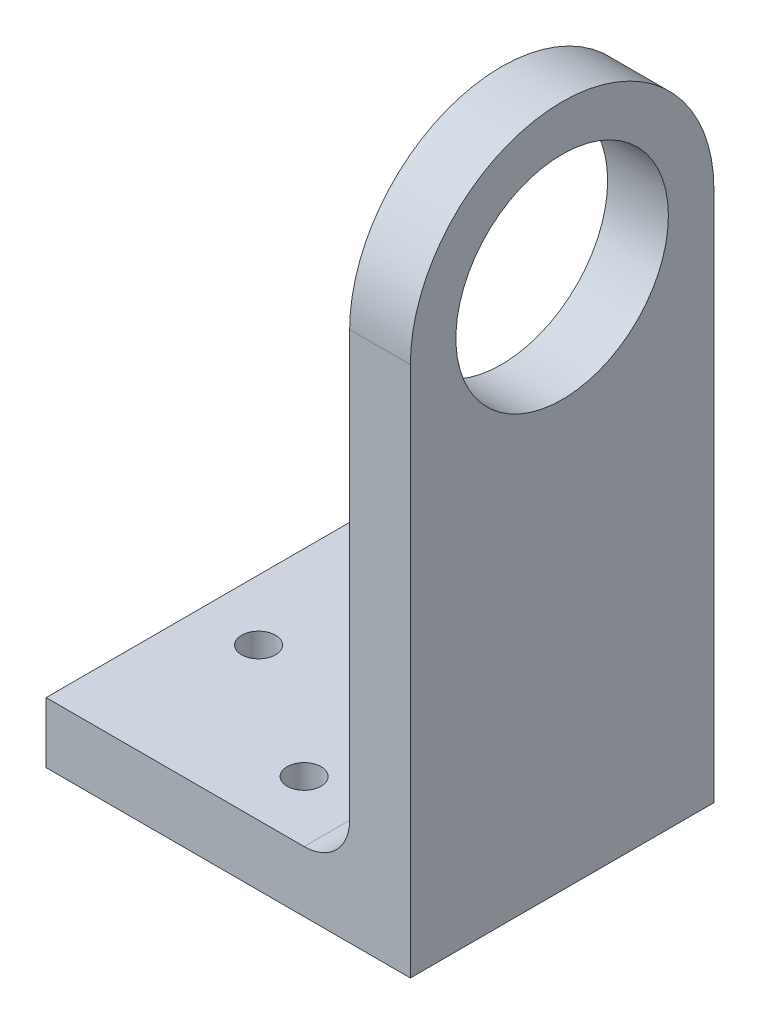
ISO-10303-21;
HEADER;
FILE_DESCRIPTION(('STEP AP214'),'2;1');
FILE_NAME('part.step','',(''),(''),'','','');
FILE_SCHEMA(('AUTOMOTIVE_DESIGN { 1 0 10303 214 1 1 1 1 }'));
ENDSEC;
DATA;
#1=APPLICATION_CONTEXT('core data for automotive mechanical design processes');
#2=APPLICATION_PROTOCOL_DEFINITION('international standard','automotive_design',2000,#1);
#3=PRODUCT_CONTEXT('',#1,'mechanical');
#4=PRODUCT('Part','Part','',(#3));
#5=PRODUCT_RELATED_PRODUCT_CATEGORY('part','',(#4));
#6=PRODUCT_DEFINITION_FORMATION('','',#4);
#7=PRODUCT_DEFINITION_CONTEXT('part definition',#1,'design');
#8=PRODUCT_DEFINITION('design','',#6,#7);
#9=PRODUCT_DEFINITION_SHAPE('','',#8);
#10=(LENGTH_UNIT() NAMED_UNIT(*) SI_UNIT(.MILLI.,.METRE.));
#11=(NAMED_UNIT(*) PLANE_ANGLE_UNIT() SI_UNIT($,.RADIAN.));
#12=(NAMED_UNIT(*) SI_UNIT($,.STERADIAN.) SOLID_ANGLE_UNIT());
#13=UNCERTAINTY_MEASURE_WITH_UNIT(LENGTH_MEASURE(1.E-05),#10,'distance_accuracy_value','');
#14=(GEOMETRIC_REPRESENTATION_CONTEXT(3) GLOBAL_UNCERTAINTY_ASSIGNED_CONTEXT((#13)) GLOBAL_UNIT_ASSIGNED_CONTEXT((#10,
#11,#12)) REPRESENTATION_CONTEXT('',''));
#15=CARTESIAN_POINT('',(0.,0.,0.));
#16=DIRECTION('',(0.,0.,1.));
#17=DIRECTION('',(1.,0.,0.));
#18=AXIS2_PLACEMENT_3D('',#15,#16,#17);
#19=CARTESIAN_POINT('',(6.35,49.2125,-15.875));
#20=DIRECTION('',(-1.,0.,0.));
#21=DIRECTION('',(0.,0.,1.));
#22=AXIS2_PLACEMENT_3D('',#19,#20,#21);
#23=PLANE('',#22);
#24=DIRECTION('',(0.,-1.,0.));
#25=VECTOR('',#24,1.);
#26=CARTESIAN_POINT('',(6.35,0.,0.));
#27=LINE('',#26,#25);
#28=CARTESIAN_POINT('',(6.35,49.2125,0.));
#29=VERTEX_POINT('',#28);
#30=CARTESIAN_POINT('',(6.35,-6.35,0.));
#31=VERTEX_POINT('',#30);
#32=EDGE_CURVE('E141',#29,#31,#27,.T.);
#33=ORIENTED_EDGE('',*,*,#32,.T.);
#34=DIRECTION('',(0.,0.,-1.));
#35=VECTOR('',#34,1.);
#36=CARTESIAN_POINT('',(6.35,-6.35,0.));
#37=LINE('',#36,#35);
#38=CARTESIAN_POINT('',(6.35,-6.34999999999999,-31.75));
#39=VERTEX_POINT('',#38);
#40=EDGE_CURVE('E101',#31,#39,#37,.T.);
#41=ORIENTED_EDGE('',*,*,#40,.T.);
#42=DIRECTION('',(0.,1.,0.));
#43=VECTOR('',#42,1.);
#44=CARTESIAN_POINT('',(6.35,0.,-31.75));
#45=LINE('',#44,#43);
#46=CARTESIAN_POINT('',(6.35,49.2125,-31.75));
#47=VERTEX_POINT('',#46);
#48=EDGE_CURVE('E143',#39,#47,#45,.T.);
#49=ORIENTED_EDGE('',*,*,#48,.T.);
#50=CARTESIAN_POINT('',(6.35,49.2125,-15.875));
#51=DIRECTION('',(1.,0.,0.));
#52=DIRECTION('',(0.,0.,1.));
#53=AXIS2_PLACEMENT_3D('',#50,#51,#52);
#54=CIRCLE('',#53,15.875);
#55=EDGE_CURVE('E146',#47,#29,#54,.T.);
#56=ORIENTED_EDGE('',*,*,#55,.T.);
#57=EDGE_LOOP('',(#33,#41,#49,#56));
#58=FACE_BOUND('',#57,.T.);
#59=CARTESIAN_POINT('',(6.35,49.2125,-15.875));
#60=DIRECTION('',(1.,0.,0.));
#61=DIRECTION('',(0.,0.,-1.));
#62=AXIS2_PLACEMENT_3D('',#59,#60,#61);
#63=CIRCLE('',#62,11.1125);
#64=CARTESIAN_POINT('',(6.35,49.2125,-26.9875));
#65=VERTEX_POINT('',#64);
#66=EDGE_CURVE('E135',#65,#65,#63,.T.);
#67=ORIENTED_EDGE('',*,*,#66,.F.);
#68=EDGE_LOOP('',(#67));
#69=FACE_BOUND('',#68,.T.);
#70=ADVANCED_FACE('F36',(#58,#69),#23,.F.);
#71=CARTESIAN_POINT('',(0.,49.2125,-15.875));
#72=DIRECTION('',(-1.,0.,0.));
#73=DIRECTION('',(0.,0.,1.));
#74=AXIS2_PLACEMENT_3D('',#71,#72,#73);
#75=PLANE('',#74);
#76=DIRECTION('',(0.,1.,0.));
#77=VECTOR('',#76,1.);
#78=CARTESIAN_POINT('',(0.,0.,-31.75));
#79=LINE('',#78,#77);
#80=CARTESIAN_POINT('',(0.,4.76250000000001,-31.75));
#81=VERTEX_POINT('',#80);
#82=CARTESIAN_POINT('',(0.,49.2125,-31.75));
#83=VERTEX_POINT('',#82);
#84=EDGE_CURVE('E150',#81,#83,#79,.T.);
#85=ORIENTED_EDGE('',*,*,#84,.F.);
#86=DIRECTION('',(0.,0.,-1.));
#87=VECTOR('',#86,1.);
#88=CARTESIAN_POINT('',(0.,4.7625,0.));
#89=LINE('',#88,#87);
#90=CARTESIAN_POINT('',(0.,4.7625,0.));
#91=VERTEX_POINT('',#90);
#92=EDGE_CURVE('E57',#81,#91,#89,.F.);
#93=ORIENTED_EDGE('',*,*,#92,.T.);
#94=DIRECTION('',(0.,-1.,0.));
#95=VECTOR('',#94,1.);
#96=CARTESIAN_POINT('',(0.,0.,0.));
#97=LINE('',#96,#95);
#98=CARTESIAN_POINT('',(0.,49.2125,0.));
#99=VERTEX_POINT('',#98);
#100=EDGE_CURVE('E138',#99,#91,#97,.T.);
#101=ORIENTED_EDGE('',*,*,#100,.F.);
#102=CARTESIAN_POINT('',(0.,49.2125,-15.875));
#103=DIRECTION('',(1.,0.,0.));
#104=DIRECTION('',(0.,0.,1.));
#105=AXIS2_PLACEMENT_3D('',#102,#103,#104);
#106=CIRCLE('',#105,15.875);
#107=EDGE_CURVE('E144',#83,#99,#106,.T.);
#108=ORIENTED_EDGE('',*,*,#107,.F.);
#109=EDGE_LOOP('',(#85,#93,#101,#108));
#110=FACE_BOUND('',#109,.T.);
#111=CARTESIAN_POINT('',(0.,49.2125,-15.875));
#112=DIRECTION('',(1.,0.,0.));
#113=DIRECTION('',(0.,0.,-1.));
#114=AXIS2_PLACEMENT_3D('',#111,#112,#113);
#115=CIRCLE('',#114,11.1125);
#116=CARTESIAN_POINT('',(0.,49.2125,-26.9875));
#117=VERTEX_POINT('',#116);
#118=EDGE_CURVE('E131',#117,#117,#115,.T.);
#119=ORIENTED_EDGE('',*,*,#118,.T.);
#120=EDGE_LOOP('',(#119));
#121=FACE_BOUND('',#120,.T.);
#122=ADVANCED_FACE('F174',(#110,#121),#75,.T.);
#123=CARTESIAN_POINT('',(6.35,0.,0.));
#124=DIRECTION('',(0.,0.,-1.));
#125=DIRECTION('',(-1.,0.,0.));
#126=AXIS2_PLACEMENT_3D('',#123,#124,#125);
#127=PLANE('',#126);
#128=ORIENTED_EDGE('',*,*,#100,.T.);
#129=CARTESIAN_POINT('',(-4.7625,4.7625,0.));
#130=DIRECTION('',(0.,0.,-1.));
#131=DIRECTION('',(-1.,0.,0.));
#132=AXIS2_PLACEMENT_3D('',#129,#130,#131);
#133=CIRCLE('',#132,4.7625);
#134=CARTESIAN_POINT('',(-4.76250000000001,0.,0.));
#135=VERTEX_POINT('',#134);
#136=EDGE_CURVE('E11',#91,#135,#133,.T.);
#137=ORIENTED_EDGE('',*,*,#136,.T.);
#138=DIRECTION('',(1.,0.,0.));
#139=VECTOR('',#138,1.);
#140=CARTESIAN_POINT('',(-31.75,0.,0.));
#141=LINE('',#140,#139);
#142=CARTESIAN_POINT('',(-31.75,0.,0.));
#143=VERTEX_POINT('',#142);
#144=EDGE_CURVE('E120',#143,#135,#141,.T.);
#145=ORIENTED_EDGE('',*,*,#144,.F.);
#146=DIRECTION('',(0.,-1.,0.));
#147=VECTOR('',#146,1.);
#148=CARTESIAN_POINT('',(-31.75,0.,0.));
#149=LINE('',#148,#147);
#150=CARTESIAN_POINT('',(-31.75,-6.35,0.));
#151=VERTEX_POINT('',#150);
#152=EDGE_CURVE('E113',#143,#151,#149,.T.);
#153=ORIENTED_EDGE('',*,*,#152,.T.);
#154=DIRECTION('',(1.,0.,0.));
#155=VECTOR('',#154,1.);
#156=CARTESIAN_POINT('',(-31.75,-6.35,0.));
#157=LINE('',#156,#155);
#158=EDGE_CURVE('E95',#151,#31,#157,.T.);
#159=ORIENTED_EDGE('',*,*,#158,.T.);
#160=ORIENTED_EDGE('',*,*,#32,.F.);
#161=DIRECTION('',(-1.,0.,0.));
#162=VECTOR('',#161,1.);
#163=CARTESIAN_POINT('',(6.35,49.2125,0.));
#164=LINE('',#163,#162);
#165=EDGE_CURVE('E148',#29,#99,#164,.T.);
#166=ORIENTED_EDGE('',*,*,#165,.T.);
#167=EDGE_LOOP('',(#128,#137,#145,#153,#159,#160,#166));
#168=FACE_BOUND('',#167,.T.);
#169=ADVANCED_FACE('F118',(#168),#127,.F.);
#170=CARTESIAN_POINT('',(6.35,0.,-31.75));
#171=DIRECTION('',(0.,0.,1.));
#172=DIRECTION('',(1.,0.,0.));
#173=AXIS2_PLACEMENT_3D('',#170,#171,#172);
#174=PLANE('',#173);
#175=DIRECTION('',(1.,0.,0.));
#176=VECTOR('',#175,1.);
#177=CARTESIAN_POINT('',(-31.75,0.,-31.75));
#178=LINE('',#177,#176);
#179=CARTESIAN_POINT('',(-31.75,0.,-31.75));
#180=VERTEX_POINT('',#179);
#181=CARTESIAN_POINT('',(-4.76250000000001,0.,-31.75));
#182=VERTEX_POINT('',#181);
#183=EDGE_CURVE('E132',#180,#182,#178,.T.);
#184=ORIENTED_EDGE('',*,*,#183,.T.);
#185=CARTESIAN_POINT('',(-4.7625,4.76250000000001,-31.75));
#186=DIRECTION('',(0.,0.,1.));
#187=DIRECTION('',(1.,0.,0.));
#188=AXIS2_PLACEMENT_3D('',#185,#186,#187);
#189=CIRCLE('',#188,4.7625);
#190=EDGE_CURVE('E44',#182,#81,#189,.T.);
#191=ORIENTED_EDGE('',*,*,#190,.T.);
#192=ORIENTED_EDGE('',*,*,#84,.T.);
#193=DIRECTION('',(-1.,0.,0.));
#194=VECTOR('',#193,1.);
#195=CARTESIAN_POINT('',(6.35,49.2125,-31.75));
#196=LINE('',#195,#194);
#197=EDGE_CURVE('E155',#47,#83,#196,.T.);
#198=ORIENTED_EDGE('',*,*,#197,.F.);
#199=ORIENTED_EDGE('',*,*,#48,.F.);
#200=DIRECTION('',(1.,0.,0.));
#201=VECTOR('',#200,1.);
#202=CARTESIAN_POINT('',(-31.75,-6.34999999999999,-31.75));
#203=LINE('',#202,#201);
#204=CARTESIAN_POINT('',(-31.75,-6.34999999999999,-31.75));
#205=VERTEX_POINT('',#204);
#206=EDGE_CURVE('E105',#205,#39,#203,.T.);
#207=ORIENTED_EDGE('',*,*,#206,.F.);
#208=DIRECTION('',(0.,1.,0.));
#209=VECTOR('',#208,1.);
#210=CARTESIAN_POINT('',(-31.75,0.,-31.75));
#211=LINE('',#210,#209);
#212=EDGE_CURVE('E116',#205,#180,#211,.T.);
#213=ORIENTED_EDGE('',*,*,#212,.T.);
#214=EDGE_LOOP('',(#184,#191,#192,#198,#199,#207,#213));
#215=FACE_BOUND('',#214,.T.);
#216=ADVANCED_FACE('F166',(#215),#174,.F.);
#217=CARTESIAN_POINT('',(6.35,49.2125,-15.875));
#218=DIRECTION('',(-1.,0.,0.));
#219=DIRECTION('',(0.,0.,1.));
#220=AXIS2_PLACEMENT_3D('',#217,#218,#219);
#221=CYLINDRICAL_SURFACE('',#220,15.875);
#222=ORIENTED_EDGE('',*,*,#107,.T.);
#223=ORIENTED_EDGE('',*,*,#165,.F.);
#224=ORIENTED_EDGE('',*,*,#55,.F.);
#225=ORIENTED_EDGE('',*,*,#197,.T.);
#226=EDGE_LOOP('',(#222,#223,#224,#225));
#227=FACE_BOUND('',#226,.T.);
#228=ADVANCED_FACE('F176',(#227),#221,.T.);
#229=CARTESIAN_POINT('',(6.35,49.2125,-15.875));
#230=DIRECTION('',(-1.,0.,0.));
#231=DIRECTION('',(0.,0.,1.));
#232=AXIS2_PLACEMENT_3D('',#229,#230,#231);
#233=CYLINDRICAL_SURFACE('',#232,11.1125);
#234=ORIENTED_EDGE('',*,*,#66,.T.);
#235=EDGE_LOOP('',(#234));
#236=FACE_BOUND('',#235,.T.);
#237=ORIENTED_EDGE('',*,*,#118,.F.);
#238=EDGE_LOOP('',(#237));
#239=FACE_BOUND('',#238,.T.);
#240=ADVANCED_FACE('F178',(#236,#239),#233,.F.);
#241=CARTESIAN_POINT('',(-31.75,0.,0.));
#242=DIRECTION('',(0.,1.,0.));
#243=DIRECTION('',(0.,0.,1.));
#244=AXIS2_PLACEMENT_3D('',#241,#242,#243);
#245=PLANE('',#244);
#246=CARTESIAN_POINT('',(-11.1125,0.,-6.35));
#247=DIRECTION('',(0.,1.,0.));
#248=DIRECTION('',(0.,0.,1.));
#249=AXIS2_PLACEMENT_3D('',#246,#247,#248);
#250=CIRCLE('',#249,1.777000002);
#251=CARTESIAN_POINT('',(-11.1125,0.,-4.572999998));
#252=VERTEX_POINT('',#251);
#253=EDGE_CURVE('E220',#252,#252,#250,.T.);
#254=ORIENTED_EDGE('',*,*,#253,.F.);
#255=EDGE_LOOP('',(#254));
#256=FACE_BOUND('',#255,.T.);
#257=CARTESIAN_POINT('',(-11.1125,0.,-25.4));
#258=DIRECTION('',(0.,1.,0.));
#259=DIRECTION('',(0.,0.,-1.));
#260=AXIS2_PLACEMENT_3D('',#257,#258,#259);
#261=CIRCLE('',#260,1.777000002);
#262=CARTESIAN_POINT('',(-11.1125,0.,-27.177000002));
#263=VERTEX_POINT('',#262);
#264=EDGE_CURVE('E221',#263,#263,#261,.T.);
#265=ORIENTED_EDGE('',*,*,#264,.F.);
#266=EDGE_LOOP('',(#265));
#267=FACE_BOUND('',#266,.T.);
#268=CARTESIAN_POINT('',(-25.4,0.,-15.875));
#269=DIRECTION('',(0.,1.,0.));
#270=DIRECTION('',(0.,0.,1.));
#271=AXIS2_PLACEMENT_3D('',#268,#269,#270);
#272=CIRCLE('',#271,1.777000002);
#273=CARTESIAN_POINT('',(-25.4,0.,-14.097999998));
#274=VERTEX_POINT('',#273);
#275=EDGE_CURVE('E229',#274,#274,#272,.T.);
#276=ORIENTED_EDGE('',*,*,#275,.F.);
#277=EDGE_LOOP('',(#276));
#278=FACE_BOUND('',#277,.T.);
#279=ORIENTED_EDGE('',*,*,#144,.T.);
#280=DIRECTION('',(0.,0.,-1.));
#281=VECTOR('',#280,1.);
#282=CARTESIAN_POINT('',(-4.7625,0.,-31.75));
#283=LINE('',#282,#281);
#284=EDGE_CURVE('E158',#135,#182,#283,.T.);
#285=ORIENTED_EDGE('',*,*,#284,.T.);
#286=ORIENTED_EDGE('',*,*,#183,.F.);
#287=DIRECTION('',(0.,0.,1.));
#288=VECTOR('',#287,1.);
#289=CARTESIAN_POINT('',(-31.75,0.,0.));
#290=LINE('',#289,#288);
#291=EDGE_CURVE('E106',#180,#143,#290,.T.);
#292=ORIENTED_EDGE('',*,*,#291,.T.);
#293=EDGE_LOOP('',(#279,#285,#286,#292));
#294=FACE_BOUND('',#293,.T.);
#295=ADVANCED_FACE('F163',(#256,#267,#278,#294),#245,.T.);
#296=CARTESIAN_POINT('',(-31.75,-6.35,0.));
#297=DIRECTION('',(0.,-1.,0.));
#298=DIRECTION('',(0.,0.,-1.));
#299=AXIS2_PLACEMENT_3D('',#296,#297,#298);
#300=PLANE('',#299);
#301=CARTESIAN_POINT('',(-11.1125,-6.35,-6.35));
#302=DIRECTION('',(0.,1.,0.));
#303=DIRECTION('',(0.,0.,1.));
#304=AXIS2_PLACEMENT_3D('',#301,#302,#303);
#305=CIRCLE('',#304,1.777000002);
#306=CARTESIAN_POINT('',(-11.1125,-6.35,-4.572999998));
#307=VERTEX_POINT('',#306);
#308=EDGE_CURVE('E122',#307,#307,#305,.T.);
#309=ORIENTED_EDGE('',*,*,#308,.T.);
#310=EDGE_LOOP('',(#309));
#311=FACE_BOUND('',#310,.T.);
#312=CARTESIAN_POINT('',(-11.1125,-6.35,-25.4));
#313=DIRECTION('',(0.,1.,0.));
#314=DIRECTION('',(0.,0.,-1.));
#315=AXIS2_PLACEMENT_3D('',#312,#313,#314);
#316=CIRCLE('',#315,1.777000002);
#317=CARTESIAN_POINT('',(-11.1125,-6.35,-27.177000002));
#318=VERTEX_POINT('',#317);
#319=EDGE_CURVE('E225',#318,#318,#316,.T.);
#320=ORIENTED_EDGE('',*,*,#319,.T.);
#321=EDGE_LOOP('',(#320));
#322=FACE_BOUND('',#321,.T.);
#323=CARTESIAN_POINT('',(-25.4,-6.35,-15.875));
#324=DIRECTION('',(0.,1.,0.));
#325=DIRECTION('',(0.,0.,1.));
#326=AXIS2_PLACEMENT_3D('',#323,#324,#325);
#327=CIRCLE('',#326,1.777000002);
#328=CARTESIAN_POINT('',(-25.4,-6.35,-14.097999998));
#329=VERTEX_POINT('',#328);
#330=EDGE_CURVE('E125',#329,#329,#327,.T.);
#331=ORIENTED_EDGE('',*,*,#330,.T.);
#332=EDGE_LOOP('',(#331));
#333=FACE_BOUND('',#332,.T.);
#334=ORIENTED_EDGE('',*,*,#40,.F.);
#335=ORIENTED_EDGE('',*,*,#158,.F.);
#336=DIRECTION('',(0.,0.,-1.));
#337=VECTOR('',#336,1.);
#338=CARTESIAN_POINT('',(-31.75,-6.35,0.));
#339=LINE('',#338,#337);
#340=EDGE_CURVE('E99',#151,#205,#339,.T.);
#341=ORIENTED_EDGE('',*,*,#340,.T.);
#342=ORIENTED_EDGE('',*,*,#206,.T.);
#343=EDGE_LOOP('',(#334,#335,#341,#342));
#344=FACE_BOUND('',#343,.T.);
#345=ADVANCED_FACE('F97',(#311,#322,#333,#344),#300,.T.);
#346=CARTESIAN_POINT('',(-31.75,0.,0.));
#347=DIRECTION('',(1.,0.,0.));
#348=DIRECTION('',(0.,0.,-1.));
#349=AXIS2_PLACEMENT_3D('',#346,#347,#348);
#350=PLANE('',#349);
#351=ORIENTED_EDGE('',*,*,#152,.F.);
#352=ORIENTED_EDGE('',*,*,#291,.F.);
#353=ORIENTED_EDGE('',*,*,#212,.F.);
#354=ORIENTED_EDGE('',*,*,#340,.F.);
#355=EDGE_LOOP('',(#351,#352,#353,#354));
#356=FACE_BOUND('',#355,.T.);
#357=ADVANCED_FACE('F111',(#356),#350,.F.);
#358=CARTESIAN_POINT('',(-4.7625,4.7625,0.));
#359=DIRECTION('',(0.,0.,1.));
#360=DIRECTION('',(0.,-1.,0.));
#361=AXIS2_PLACEMENT_3D('',#358,#359,#360);
#362=CYLINDRICAL_SURFACE('',#361,4.7625);
#363=ORIENTED_EDGE('',*,*,#136,.F.);
#364=ORIENTED_EDGE('',*,*,#92,.F.);
#365=ORIENTED_EDGE('',*,*,#190,.F.);
#366=ORIENTED_EDGE('',*,*,#284,.F.);
#367=EDGE_LOOP('',(#363,#364,#365,#366));
#368=FACE_BOUND('',#367,.T.);
#369=ADVANCED_FACE('F38',(#368),#362,.F.);
#370=CARTESIAN_POINT('',(-25.4,-6.35,-15.875));
#371=DIRECTION('',(0.,1.,0.));
#372=DIRECTION('',(0.,0.,1.));
#373=AXIS2_PLACEMENT_3D('',#370,#371,#372);
#374=CYLINDRICAL_SURFACE('',#373,1.777000002);
#375=ORIENTED_EDGE('',*,*,#330,.F.);
#376=EDGE_LOOP('',(#375));
#377=FACE_BOUND('',#376,.T.);
#378=ORIENTED_EDGE('',*,*,#275,.T.);
#379=EDGE_LOOP('',(#378));
#380=FACE_BOUND('',#379,.T.);
#381=ADVANCED_FACE('F202',(#377,#380),#374,.F.);
#382=CARTESIAN_POINT('',(-11.1125,-6.35,-25.4));
#383=DIRECTION('',(0.,1.,0.));
#384=DIRECTION('',(0.,0.,1.));
#385=AXIS2_PLACEMENT_3D('',#382,#383,#384);
#386=CYLINDRICAL_SURFACE('',#385,1.777000002);
#387=ORIENTED_EDGE('',*,*,#319,.F.);
#388=EDGE_LOOP('',(#387));
#389=FACE_BOUND('',#388,.T.);
#390=ORIENTED_EDGE('',*,*,#264,.T.);
#391=EDGE_LOOP('',(#390));
#392=FACE_BOUND('',#391,.T.);
#393=ADVANCED_FACE('F205',(#389,#392),#386,.F.);
#394=CARTESIAN_POINT('',(-11.1125,-6.35,-6.35));
#395=DIRECTION('',(0.,1.,0.));
#396=DIRECTION('',(0.,0.,1.));
#397=AXIS2_PLACEMENT_3D('',#394,#395,#396);
#398=CYLINDRICAL_SURFACE('',#397,1.777000002);
#399=ORIENTED_EDGE('',*,*,#308,.F.);
#400=EDGE_LOOP('',(#399));
#401=FACE_BOUND('',#400,.T.);
#402=ORIENTED_EDGE('',*,*,#253,.T.);
#403=EDGE_LOOP('',(#402));
#404=FACE_BOUND('',#403,.T.);
#405=ADVANCED_FACE('F209',(#401,#404),#398,.F.);
#406=CLOSED_SHELL('',(#70,#122,#169,#216,#228,#240,#295,#345,#357,#369,#381,#393,#405));
#407=MANIFOLD_SOLID_BREP('B2',#406);
#408=ADVANCED_BREP_SHAPE_REPRESENTATION('',(#18,#407),#14);
#409=SHAPE_DEFINITION_REPRESENTATION(#9,#408);
ENDSEC;
END-ISO-10303-21;
